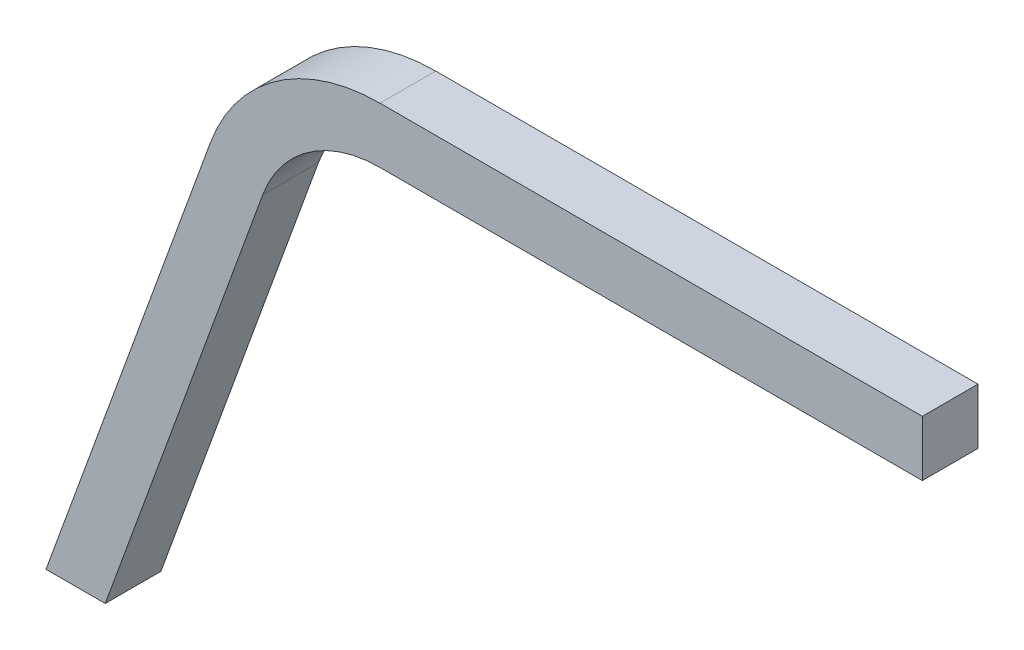
ISO-10303-21;
HEADER;
FILE_DESCRIPTION(('STEP AP214'),'2;1');
FILE_NAME('part.step','',(''),(''),'','','');
FILE_SCHEMA(('AUTOMOTIVE_DESIGN { 1 0 10303 214 1 1 1 1 }'));
ENDSEC;
DATA;
#1=APPLICATION_CONTEXT('core data for automotive mechanical design processes');
#2=APPLICATION_PROTOCOL_DEFINITION('international standard','automotive_design',2000,#1);
#3=PRODUCT_CONTEXT('',#1,'mechanical');
#4=PRODUCT('Part','Part','',(#3));
#5=PRODUCT_RELATED_PRODUCT_CATEGORY('part','',(#4));
#6=PRODUCT_DEFINITION_FORMATION('','',#4);
#7=PRODUCT_DEFINITION_CONTEXT('part definition',#1,'design');
#8=PRODUCT_DEFINITION('design','',#6,#7);
#9=PRODUCT_DEFINITION_SHAPE('','',#8);
#10=(LENGTH_UNIT() NAMED_UNIT(*) SI_UNIT(.MILLI.,.METRE.));
#11=(NAMED_UNIT(*) PLANE_ANGLE_UNIT() SI_UNIT($,.RADIAN.));
#12=(NAMED_UNIT(*) SI_UNIT($,.STERADIAN.) SOLID_ANGLE_UNIT());
#13=UNCERTAINTY_MEASURE_WITH_UNIT(LENGTH_MEASURE(1.E-05),#10,'distance_accuracy_value','');
#14=(GEOMETRIC_REPRESENTATION_CONTEXT(3) GLOBAL_UNCERTAINTY_ASSIGNED_CONTEXT((#13)) GLOBAL_UNIT_ASSIGNED_CONTEXT((#10,
#11,#12)) REPRESENTATION_CONTEXT('',''));
#15=CARTESIAN_POINT('',(0.,0.,0.));
#16=DIRECTION('',(0.,0.,1.));
#17=DIRECTION('',(1.,0.,0.));
#18=AXIS2_PLACEMENT_3D('',#15,#16,#17);
#19=CARTESIAN_POINT('',(6.75752885522205,0.,6.35));
#20=DIRECTION('',(0.,1.,0.));
#21=DIRECTION('',(-1.,0.,0.));
#22=AXIS2_PLACEMENT_3D('',#19,#20,#21);
#23=PLANE('',#22);
#24=DIRECTION('',(1.,0.,0.));
#25=VECTOR('',#24,1.);
#26=CARTESIAN_POINT('',(6.75752885522205,0.,0.));
#27=LINE('',#26,#25);
#28=CARTESIAN_POINT('',(0.,0.,0.));
#29=VERTEX_POINT('',#28);
#30=CARTESIAN_POINT('',(6.75752885522205,0.,0.));
#31=VERTEX_POINT('',#30);
#32=EDGE_CURVE('E127',#29,#31,#27,.T.);
#33=ORIENTED_EDGE('',*,*,#32,.T.);
#34=DIRECTION('',(0.,0.,-1.));
#35=VECTOR('',#34,1.);
#36=CARTESIAN_POINT('',(6.75752885522205,0.,6.35));
#37=LINE('',#36,#35);
#38=CARTESIAN_POINT('',(6.75752885522205,0.,6.35));
#39=VERTEX_POINT('',#38);
#40=EDGE_CURVE('E11',#39,#31,#37,.T.);
#41=ORIENTED_EDGE('',*,*,#40,.F.);
#42=DIRECTION('',(1.,0.,0.));
#43=VECTOR('',#42,1.);
#44=CARTESIAN_POINT('',(6.75752885522205,0.,6.35));
#45=LINE('',#44,#43);
#46=CARTESIAN_POINT('',(0.,0.,6.35));
#47=VERTEX_POINT('',#46);
#48=EDGE_CURVE('E141',#47,#39,#45,.T.);
#49=ORIENTED_EDGE('',*,*,#48,.F.);
#50=DIRECTION('',(0.,0.,-1.));
#51=VECTOR('',#50,1.);
#52=CARTESIAN_POINT('',(0.,0.,6.35));
#53=LINE('',#52,#51);
#54=EDGE_CURVE('E123',#47,#29,#53,.T.);
#55=ORIENTED_EDGE('',*,*,#54,.T.);
#56=EDGE_LOOP('',(#33,#41,#49,#55));
#57=FACE_BOUND('',#56,.T.);
#58=ADVANCED_FACE('F31',(#57),#23,.F.);
#59=CARTESIAN_POINT('',(6.75752885522205,0.,6.35));
#60=DIRECTION('',(-0.939692620785907,0.342020143325673,0.));
#61=DIRECTION('',(-0.342020143325673,-0.939692620785907,0.));
#62=AXIS2_PLACEMENT_3D('',#59,#60,#61);
#63=PLANE('',#62);
#64=DIRECTION('',(0.342020143325673,0.939692620785907,0.));
#65=VECTOR('',#64,1.);
#66=CARTESIAN_POINT('',(6.75752885522205,0.,0.));
#67=LINE('',#66,#65);
#68=CARTESIAN_POINT('',(24.7284206147075,49.3746193166487,0.));
#69=VERTEX_POINT('',#68);
#70=EDGE_CURVE('E130',#31,#69,#67,.T.);
#71=ORIENTED_EDGE('',*,*,#70,.T.);
#72=DIRECTION('',(0.,0.,-1.));
#73=VECTOR('',#72,1.);
#74=CARTESIAN_POINT('',(24.7284206147075,49.3746193166487,6.35));
#75=LINE('',#74,#73);
#76=CARTESIAN_POINT('',(24.7284206147075,49.3746193166487,6.35));
#77=VERTEX_POINT('',#76);
#78=EDGE_CURVE('E39',#77,#69,#75,.T.);
#79=ORIENTED_EDGE('',*,*,#78,.F.);
#80=DIRECTION('',(0.342020143325673,0.939692620785907,0.));
#81=VECTOR('',#80,1.);
#82=CARTESIAN_POINT('',(6.75752885522205,0.,6.35));
#83=LINE('',#82,#81);
#84=EDGE_CURVE('E90',#39,#77,#83,.T.);
#85=ORIENTED_EDGE('',*,*,#84,.F.);
#86=ORIENTED_EDGE('',*,*,#40,.T.);
#87=EDGE_LOOP('',(#71,#79,#85,#86));
#88=FACE_BOUND('',#87,.T.);
#89=ADVANCED_FACE('F176',(#88),#63,.F.);
#90=CARTESIAN_POINT('',(38.1,44.5077624352745,6.35));
#91=DIRECTION('',(0.,0.,-1.));
#92=DIRECTION('',(-1.,0.,0.));
#93=AXIS2_PLACEMENT_3D('',#90,#91,#92);
#94=CYLINDRICAL_SURFACE('',#93,14.2297375647255);
#95=CARTESIAN_POINT('',(38.1,44.5077624352745,0.));
#96=DIRECTION('',(0.,0.,-1.));
#97=DIRECTION('',(-1.,0.,0.));
#98=AXIS2_PLACEMENT_3D('',#95,#96,#97);
#99=CIRCLE('',#98,14.2297375647255);
#100=CARTESIAN_POINT('',(38.1,58.7375,0.));
#101=VERTEX_POINT('',#100);
#102=EDGE_CURVE('E132',#69,#101,#99,.T.);
#103=ORIENTED_EDGE('',*,*,#102,.T.);
#104=DIRECTION('',(0.,0.,-1.));
#105=VECTOR('',#104,1.);
#106=CARTESIAN_POINT('',(38.1,58.7375,6.35));
#107=LINE('',#106,#105);
#108=CARTESIAN_POINT('',(38.1,58.7375,6.35));
#109=VERTEX_POINT('',#108);
#110=EDGE_CURVE('E148',#109,#101,#107,.T.);
#111=ORIENTED_EDGE('',*,*,#110,.F.);
#112=CARTESIAN_POINT('',(38.1,44.5077624352745,6.35));
#113=DIRECTION('',(0.,0.,-1.));
#114=DIRECTION('',(-1.,0.,0.));
#115=AXIS2_PLACEMENT_3D('',#112,#113,#114);
#116=CIRCLE('',#115,14.2297375647255);
#117=EDGE_CURVE('E156',#77,#109,#116,.T.);
#118=ORIENTED_EDGE('',*,*,#117,.F.);
#119=ORIENTED_EDGE('',*,*,#78,.T.);
#120=EDGE_LOOP('',(#103,#111,#118,#119));
#121=FACE_BOUND('',#120,.T.);
#122=ADVANCED_FACE('F154',(#121),#94,.F.);
#123=CARTESIAN_POINT('',(99.949,58.7375,6.35));
#124=DIRECTION('',(0.,1.,0.));
#125=DIRECTION('',(0.,0.,1.));
#126=AXIS2_PLACEMENT_3D('',#123,#124,#125);
#127=PLANE('',#126);
#128=DIRECTION('',(1.,0.,0.));
#129=VECTOR('',#128,1.);
#130=CARTESIAN_POINT('',(99.949,58.7375,0.));
#131=LINE('',#130,#129);
#132=CARTESIAN_POINT('',(99.949,58.7375,0.));
#133=VERTEX_POINT('',#132);
#134=EDGE_CURVE('E134',#101,#133,#131,.T.);
#135=ORIENTED_EDGE('',*,*,#134,.T.);
#136=DIRECTION('',(0.,0.,-1.));
#137=VECTOR('',#136,1.);
#138=CARTESIAN_POINT('',(99.949,58.7375,6.35));
#139=LINE('',#138,#137);
#140=CARTESIAN_POINT('',(99.949,58.7375,6.35));
#141=VERTEX_POINT('',#140);
#142=EDGE_CURVE('E145',#141,#133,#139,.T.);
#143=ORIENTED_EDGE('',*,*,#142,.F.);
#144=DIRECTION('',(1.,0.,0.));
#145=VECTOR('',#144,1.);
#146=CARTESIAN_POINT('',(99.949,58.7375,6.35));
#147=LINE('',#146,#145);
#148=EDGE_CURVE('E168',#109,#141,#147,.T.);
#149=ORIENTED_EDGE('',*,*,#148,.F.);
#150=ORIENTED_EDGE('',*,*,#110,.T.);
#151=EDGE_LOOP('',(#135,#143,#149,#150));
#152=FACE_BOUND('',#151,.T.);
#153=ADVANCED_FACE('F164',(#152),#127,.F.);
#154=CARTESIAN_POINT('',(99.949,65.0875,6.35));
#155=DIRECTION('',(-1.,0.,0.));
#156=DIRECTION('',(0.,0.,1.));
#157=AXIS2_PLACEMENT_3D('',#154,#155,#156);
#158=PLANE('',#157);
#159=DIRECTION('',(0.,1.,0.));
#160=VECTOR('',#159,1.);
#161=CARTESIAN_POINT('',(99.949,65.0875,0.));
#162=LINE('',#161,#160);
#163=CARTESIAN_POINT('',(99.949,65.0875,0.));
#164=VERTEX_POINT('',#163);
#165=EDGE_CURVE('E136',#133,#164,#162,.T.);
#166=ORIENTED_EDGE('',*,*,#165,.T.);
#167=DIRECTION('',(0.,0.,-1.));
#168=VECTOR('',#167,1.);
#169=CARTESIAN_POINT('',(99.949,65.0875,6.35));
#170=LINE('',#169,#168);
#171=CARTESIAN_POINT('',(99.949,65.0875,6.35));
#172=VERTEX_POINT('',#171);
#173=EDGE_CURVE('E118',#172,#164,#170,.T.);
#174=ORIENTED_EDGE('',*,*,#173,.F.);
#175=DIRECTION('',(0.,1.,0.));
#176=VECTOR('',#175,1.);
#177=CARTESIAN_POINT('',(99.949,65.0875,6.35));
#178=LINE('',#177,#176);
#179=EDGE_CURVE('E109',#141,#172,#178,.T.);
#180=ORIENTED_EDGE('',*,*,#179,.F.);
#181=ORIENTED_EDGE('',*,*,#142,.T.);
#182=EDGE_LOOP('',(#166,#174,#180,#181));
#183=FACE_BOUND('',#182,.T.);
#184=ADVANCED_FACE('F167',(#183),#158,.F.);
#185=CARTESIAN_POINT('',(99.949,65.0875,6.35));
#186=DIRECTION('',(0.,-1.,0.));
#187=DIRECTION('',(1.,0.,0.));
#188=AXIS2_PLACEMENT_3D('',#185,#186,#187);
#189=PLANE('',#188);
#190=DIRECTION('',(-1.,0.,0.));
#191=VECTOR('',#190,1.);
#192=CARTESIAN_POINT('',(99.949,65.0875,0.));
#193=LINE('',#192,#191);
#194=CARTESIAN_POINT('',(38.1,65.0875,0.));
#195=VERTEX_POINT('',#194);
#196=EDGE_CURVE('E117',#164,#195,#193,.T.);
#197=ORIENTED_EDGE('',*,*,#196,.T.);
#198=DIRECTION('',(0.,0.,-1.));
#199=VECTOR('',#198,1.);
#200=CARTESIAN_POINT('',(38.1,65.0875,6.35));
#201=LINE('',#200,#199);
#202=CARTESIAN_POINT('',(38.1,65.0875,6.35));
#203=VERTEX_POINT('',#202);
#204=EDGE_CURVE('E114',#203,#195,#201,.T.);
#205=ORIENTED_EDGE('',*,*,#204,.F.);
#206=DIRECTION('',(-1.,0.,0.));
#207=VECTOR('',#206,1.);
#208=CARTESIAN_POINT('',(99.949,65.0875,6.35));
#209=LINE('',#208,#207);
#210=EDGE_CURVE('E103',#172,#203,#209,.T.);
#211=ORIENTED_EDGE('',*,*,#210,.F.);
#212=ORIENTED_EDGE('',*,*,#173,.T.);
#213=EDGE_LOOP('',(#197,#205,#211,#212));
#214=FACE_BOUND('',#213,.T.);
#215=ADVANCED_FACE('F115',(#214),#189,.F.);
#216=CARTESIAN_POINT('',(38.1,44.5077624352745,6.35));
#217=DIRECTION('',(0.,0.,-1.));
#218=DIRECTION('',(-1.,0.,0.));
#219=AXIS2_PLACEMENT_3D('',#216,#217,#218);
#220=CYLINDRICAL_SURFACE('',#219,20.5797375647255);
#221=CARTESIAN_POINT('',(38.1,44.5077624352745,0.));
#222=DIRECTION('',(0.,0.,1.));
#223=DIRECTION('',(-1.,0.,0.));
#224=AXIS2_PLACEMENT_3D('',#221,#222,#223);
#225=CIRCLE('',#224,20.5797375647255);
#226=CARTESIAN_POINT('',(18.7613724727169,51.5464472267667,0.));
#227=VERTEX_POINT('',#226);
#228=EDGE_CURVE('E76',#195,#227,#225,.T.);
#229=ORIENTED_EDGE('',*,*,#228,.T.);
#230=DIRECTION('',(0.,0.,-1.));
#231=VECTOR('',#230,1.);
#232=CARTESIAN_POINT('',(18.7613724727169,51.5464472267667,6.35));
#233=LINE('',#232,#231);
#234=CARTESIAN_POINT('',(18.7613724727169,51.5464472267667,6.35));
#235=VERTEX_POINT('',#234);
#236=EDGE_CURVE('E119',#235,#227,#233,.T.);
#237=ORIENTED_EDGE('',*,*,#236,.F.);
#238=CARTESIAN_POINT('',(38.1,44.5077624352745,6.35));
#239=DIRECTION('',(0.,0.,1.));
#240=DIRECTION('',(-1.,0.,0.));
#241=AXIS2_PLACEMENT_3D('',#238,#239,#240);
#242=CIRCLE('',#241,20.5797375647255);
#243=EDGE_CURVE('E107',#203,#235,#242,.T.);
#244=ORIENTED_EDGE('',*,*,#243,.F.);
#245=ORIENTED_EDGE('',*,*,#204,.T.);
#246=EDGE_LOOP('',(#229,#237,#244,#245));
#247=FACE_BOUND('',#246,.T.);
#248=ADVANCED_FACE('F121',(#247),#220,.T.);
#249=CARTESIAN_POINT('',(0.,0.,6.35));
#250=DIRECTION('',(0.939692620785907,-0.342020143325672,0.));
#251=DIRECTION('',(0.342020143325672,0.939692620785907,0.));
#252=AXIS2_PLACEMENT_3D('',#249,#250,#251);
#253=PLANE('',#252);
#254=DIRECTION('',(-0.342020143325672,-0.939692620785907,0.));
#255=VECTOR('',#254,1.);
#256=CARTESIAN_POINT('',(0.,0.,0.));
#257=LINE('',#256,#255);
#258=EDGE_CURVE('E82',#227,#29,#257,.T.);
#259=ORIENTED_EDGE('',*,*,#258,.T.);
#260=ORIENTED_EDGE('',*,*,#54,.F.);
#261=DIRECTION('',(-0.342020143325672,-0.939692620785907,0.));
#262=VECTOR('',#261,1.);
#263=CARTESIAN_POINT('',(0.,0.,6.35));
#264=LINE('',#263,#262);
#265=EDGE_CURVE('E47',#235,#47,#264,.T.);
#266=ORIENTED_EDGE('',*,*,#265,.F.);
#267=ORIENTED_EDGE('',*,*,#236,.T.);
#268=EDGE_LOOP('',(#259,#260,#266,#267));
#269=FACE_BOUND('',#268,.T.);
#270=ADVANCED_FACE('F192',(#269),#253,.F.);
#271=CARTESIAN_POINT('',(38.1,44.5077624352745,6.35));
#272=DIRECTION('',(0.,0.,-1.));
#273=DIRECTION('',(-1.,0.,0.));
#274=AXIS2_PLACEMENT_3D('',#271,#272,#273);
#275=PLANE('',#274);
#276=ORIENTED_EDGE('',*,*,#48,.T.);
#277=ORIENTED_EDGE('',*,*,#84,.T.);
#278=ORIENTED_EDGE('',*,*,#117,.T.);
#279=ORIENTED_EDGE('',*,*,#148,.T.);
#280=ORIENTED_EDGE('',*,*,#179,.T.);
#281=ORIENTED_EDGE('',*,*,#210,.T.);
#282=ORIENTED_EDGE('',*,*,#243,.T.);
#283=ORIENTED_EDGE('',*,*,#265,.T.);
#284=EDGE_LOOP('',(#276,#277,#278,#279,#280,#281,#282,#283));
#285=FACE_BOUND('',#284,.T.);
#286=ADVANCED_FACE('F105',(#285),#275,.F.);
#287=CARTESIAN_POINT('',(38.1,44.5077624352745,0.));
#288=DIRECTION('',(0.,0.,-1.));
#289=DIRECTION('',(-1.,0.,0.));
#290=AXIS2_PLACEMENT_3D('',#287,#288,#289);
#291=PLANE('',#290);
#292=ORIENTED_EDGE('',*,*,#32,.F.);
#293=ORIENTED_EDGE('',*,*,#258,.F.);
#294=ORIENTED_EDGE('',*,*,#228,.F.);
#295=ORIENTED_EDGE('',*,*,#196,.F.);
#296=ORIENTED_EDGE('',*,*,#165,.F.);
#297=ORIENTED_EDGE('',*,*,#134,.F.);
#298=ORIENTED_EDGE('',*,*,#102,.F.);
#299=ORIENTED_EDGE('',*,*,#70,.F.);
#300=EDGE_LOOP('',(#292,#293,#294,#295,#296,#297,#298,#299));
#301=FACE_BOUND('',#300,.T.);
#302=ADVANCED_FACE('F160',(#301),#291,.T.);
#303=CLOSED_SHELL('',(#58,#89,#122,#153,#184,#215,#248,#270,#286,#302));
#304=MANIFOLD_SOLID_BREP('B2',#303);
#305=ADVANCED_BREP_SHAPE_REPRESENTATION('',(#18,#304),#14);
#306=SHAPE_DEFINITION_REPRESENTATION(#9,#305);
ENDSEC;
END-ISO-10303-21;
